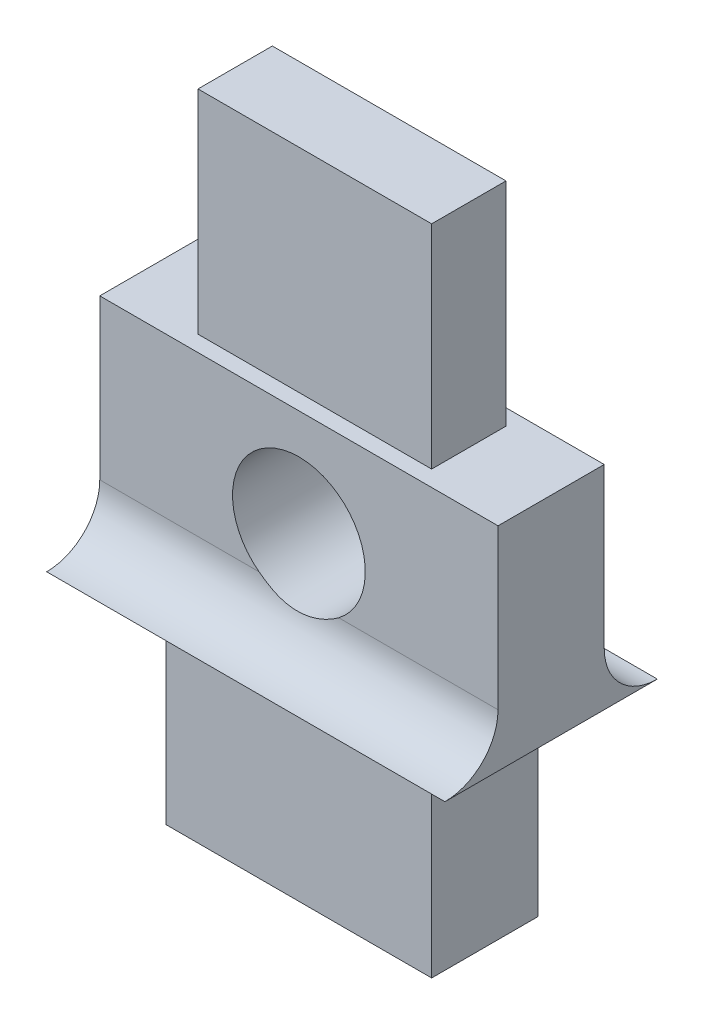
ISO-10303-21;
HEADER;
FILE_DESCRIPTION(('STEP AP214'),'2;1');
FILE_NAME('part.step','',(''),(''),'','','');
FILE_SCHEMA(('AUTOMOTIVE_DESIGN { 1 0 10303 214 1 1 1 1 }'));
ENDSEC;
DATA;
#1=APPLICATION_CONTEXT('core data for automotive mechanical design processes');
#2=APPLICATION_PROTOCOL_DEFINITION('international standard','automotive_design',2000,#1);
#3=PRODUCT_CONTEXT('',#1,'mechanical');
#4=PRODUCT('Part','Part','',(#3));
#5=PRODUCT_RELATED_PRODUCT_CATEGORY('part','',(#4));
#6=PRODUCT_DEFINITION_FORMATION('','',#4);
#7=PRODUCT_DEFINITION_CONTEXT('part definition',#1,'design');
#8=PRODUCT_DEFINITION('design','',#6,#7);
#9=PRODUCT_DEFINITION_SHAPE('','',#8);
#10=(LENGTH_UNIT() NAMED_UNIT(*) SI_UNIT(.MILLI.,.METRE.));
#11=(NAMED_UNIT(*) PLANE_ANGLE_UNIT() SI_UNIT($,.RADIAN.));
#12=(NAMED_UNIT(*) SI_UNIT($,.STERADIAN.) SOLID_ANGLE_UNIT());
#13=UNCERTAINTY_MEASURE_WITH_UNIT(LENGTH_MEASURE(1.E-05),#10,'distance_accuracy_value','');
#14=(GEOMETRIC_REPRESENTATION_CONTEXT(3) GLOBAL_UNCERTAINTY_ASSIGNED_CONTEXT((#13)) GLOBAL_UNIT_ASSIGNED_CONTEXT((#10,
#11,#12)) REPRESENTATION_CONTEXT('',''));
#15=CARTESIAN_POINT('',(0.,0.,0.));
#16=DIRECTION('',(0.,0.,1.));
#17=DIRECTION('',(1.,0.,0.));
#18=AXIS2_PLACEMENT_3D('',#15,#16,#17);
#19=CARTESIAN_POINT('',(0.,0.,0.));
#20=DIRECTION('',(0.,0.,-1.));
#21=DIRECTION('',(-1.,0.,0.));
#22=AXIS2_PLACEMENT_3D('',#19,#20,#21);
#23=PLANE('',#22);
#24=DIRECTION('',(0.,-1.,0.));
#25=VECTOR('',#24,1.);
#26=CARTESIAN_POINT('',(1950.92680872112,1462.88411595094,0.));
#27=LINE('',#26,#25);
#28=CARTESIAN_POINT('',(1950.92680872112,1462.88411595094,0.));
#29=VERTEX_POINT('',#28);
#30=CARTESIAN_POINT('',(1950.92680872112,1459.88411595094,0.));
#31=VERTEX_POINT('',#30);
#32=EDGE_CURVE('E294',#29,#31,#27,.T.);
#33=ORIENTED_EDGE('',*,*,#32,.F.);
#34=DIRECTION('',(-1.,0.,0.));
#35=VECTOR('',#34,1.);
#36=CARTESIAN_POINT('',(1957.17680872112,1462.88411595094,0.));
#37=LINE('',#36,#35);
#38=CARTESIAN_POINT('',(1958.42680872112,1462.88411595094,0.));
#39=VERTEX_POINT('',#38);
#40=EDGE_CURVE('E319',#39,#29,#37,.T.);
#41=ORIENTED_EDGE('',*,*,#40,.F.);
#42=DIRECTION('',(1.11022302462522E-13,1.,0.));
#43=VECTOR('',#42,1.);
#44=CARTESIAN_POINT('',(1958.42680872112,1462.88411595094,0.));
#45=LINE('',#44,#43);
#46=CARTESIAN_POINT('',(1958.42680872112,1459.88411595094,0.));
#47=VERTEX_POINT('',#46);
#48=EDGE_CURVE('E260',#47,#39,#45,.T.);
#49=ORIENTED_EDGE('',*,*,#48,.F.);
#50=DIRECTION('',(-1.,0.,0.));
#51=VECTOR('',#50,1.);
#52=CARTESIAN_POINT('',(1959.84102228349,1459.88411595094,0.));
#53=LINE('',#52,#51);
#54=CARTESIAN_POINT('',(1955.42680872111,1459.88411595094,0.));
#55=VERTEX_POINT('',#54);
#56=EDGE_CURVE('E297',#47,#55,#53,.T.);
#57=ORIENTED_EDGE('',*,*,#56,.T.);
#58=CARTESIAN_POINT('',(1954.67680872112,1460.88411595095,0.));
#59=DIRECTION('',(0.,0.,1.));
#60=DIRECTION('',(1.,0.,0.));
#61=AXIS2_PLACEMENT_3D('',#58,#59,#60);
#62=CIRCLE('',#61,1.24999999999997);
#63=CARTESIAN_POINT('',(1953.92680872112,1459.88411595094,0.));
#64=VERTEX_POINT('',#63);
#65=EDGE_CURVE('E311',#55,#64,#62,.T.);
#66=ORIENTED_EDGE('',*,*,#65,.T.);
#67=EDGE_CURVE('E55',#64,#31,#53,.T.);
#68=ORIENTED_EDGE('',*,*,#67,.T.);
#69=EDGE_LOOP('',(#33,#41,#49,#57,#66,#68));
#70=FACE_BOUND('',#69,.T.);
#71=ADVANCED_FACE('F32',(#70),#23,.T.);
#72=CARTESIAN_POINT('',(0.,0.,2.));
#73=DIRECTION('',(0.,0.,-1.));
#74=DIRECTION('',(-1.,0.,0.));
#75=AXIS2_PLACEMENT_3D('',#72,#73,#74);
#76=PLANE('',#75);
#77=DIRECTION('',(0.,1.,0.));
#78=VECTOR('',#77,1.);
#79=CARTESIAN_POINT('',(1957.17680872112,1458.88411595094,2.));
#80=LINE('',#79,#78);
#81=CARTESIAN_POINT('',(1957.17680872112,1454.88411595094,2.));
#82=VERTEX_POINT('',#81);
#83=CARTESIAN_POINT('',(1957.17680872112,1458.88411595094,2.));
#84=VERTEX_POINT('',#83);
#85=EDGE_CURVE('E326',#82,#84,#80,.T.);
#86=ORIENTED_EDGE('',*,*,#85,.T.);
#87=DIRECTION('',(-1.,0.,0.));
#88=VECTOR('',#87,1.);
#89=CARTESIAN_POINT('',(1959.84102228349,1458.88411595094,2.));
#90=LINE('',#89,#88);
#91=CARTESIAN_POINT('',(1952.17680872112,1458.88411595094,2.));
#92=VERTEX_POINT('',#91);
#93=EDGE_CURVE('E265',#84,#92,#90,.T.);
#94=ORIENTED_EDGE('',*,*,#93,.T.);
#95=DIRECTION('',(-2.22044604925031E-13,-1.,0.));
#96=VECTOR('',#95,1.);
#97=CARTESIAN_POINT('',(1952.17680872112,1458.88411595094,2.));
#98=LINE('',#97,#96);
#99=CARTESIAN_POINT('',(1952.17680872112,1454.88411595094,2.));
#100=VERTEX_POINT('',#99);
#101=EDGE_CURVE('E322',#92,#100,#98,.T.);
#102=ORIENTED_EDGE('',*,*,#101,.T.);
#103=DIRECTION('',(1.,0.,0.));
#104=VECTOR('',#103,1.);
#105=CARTESIAN_POINT('',(1952.17680872112,1454.88411595094,2.));
#106=LINE('',#105,#104);
#107=EDGE_CURVE('E324',#100,#82,#106,.T.);
#108=ORIENTED_EDGE('',*,*,#107,.T.);
#109=EDGE_LOOP('',(#86,#94,#102,#108));
#110=FACE_BOUND('',#109,.T.);
#111=ADVANCED_FACE('F219',(#110),#76,.F.);
#112=DIRECTION('',(1.11022302462522E-13,1.,0.));
#113=VECTOR('',#112,1.);
#114=CARTESIAN_POINT('',(1958.42680872112,1462.88411595094,2.));
#115=LINE('',#114,#113);
#116=CARTESIAN_POINT('',(1958.42680872112,1459.88411595094,2.));
#117=VERTEX_POINT('',#116);
#118=CARTESIAN_POINT('',(1958.42680872112,1462.88411595094,2.));
#119=VERTEX_POINT('',#118);
#120=EDGE_CURVE('E328',#117,#119,#115,.T.);
#121=ORIENTED_EDGE('',*,*,#120,.T.);
#122=DIRECTION('',(-1.,0.,0.));
#123=VECTOR('',#122,1.);
#124=CARTESIAN_POINT('',(1952.17680872112,1462.88411595094,2.));
#125=LINE('',#124,#123);
#126=CARTESIAN_POINT('',(1950.92680872112,1462.88411595094,2.));
#127=VERTEX_POINT('',#126);
#128=EDGE_CURVE('E316',#119,#127,#125,.T.);
#129=ORIENTED_EDGE('',*,*,#128,.T.);
#130=DIRECTION('',(0.,-1.,0.));
#131=VECTOR('',#130,1.);
#132=CARTESIAN_POINT('',(1950.92680872112,1462.88411595094,2.));
#133=LINE('',#132,#131);
#134=CARTESIAN_POINT('',(1950.92680872112,1459.88411595094,2.));
#135=VERTEX_POINT('',#134);
#136=EDGE_CURVE('E318',#127,#135,#133,.T.);
#137=ORIENTED_EDGE('',*,*,#136,.T.);
#138=DIRECTION('',(-1.,0.,0.));
#139=VECTOR('',#138,1.);
#140=CARTESIAN_POINT('',(1959.84102228349,1459.88411595094,2.));
#141=LINE('',#140,#139);
#142=CARTESIAN_POINT('',(1953.92680872112,1459.88411595094,2.));
#143=VERTEX_POINT('',#142);
#144=EDGE_CURVE('E307',#143,#135,#141,.T.);
#145=ORIENTED_EDGE('',*,*,#144,.F.);
#146=CARTESIAN_POINT('',(1954.67680872112,1460.88411595095,2.));
#147=DIRECTION('',(0.,0.,1.));
#148=DIRECTION('',(1.,0.,0.));
#149=AXIS2_PLACEMENT_3D('',#146,#147,#148);
#150=CIRCLE('',#149,1.24999999999997);
#151=CARTESIAN_POINT('',(1955.42680872111,1459.88411595094,2.00000000000006));
#152=VERTEX_POINT('',#151);
#153=EDGE_CURVE('E312',#152,#143,#150,.T.);
#154=ORIENTED_EDGE('',*,*,#153,.F.);
#155=EDGE_CURVE('E304',#117,#152,#141,.T.);
#156=ORIENTED_EDGE('',*,*,#155,.F.);
#157=EDGE_LOOP('',(#121,#129,#137,#145,#154,#156));
#158=FACE_BOUND('',#157,.T.);
#159=ADVANCED_FACE('F225',(#158),#76,.F.);
#160=DIRECTION('',(-1.,0.,0.));
#161=VECTOR('',#160,1.);
#162=CARTESIAN_POINT('',(1959.84102228349,1458.88411595094,0.));
#163=LINE('',#162,#161);
#164=CARTESIAN_POINT('',(1957.17680872112,1458.88411595094,0.));
#165=VERTEX_POINT('',#164);
#166=CARTESIAN_POINT('',(1952.17680872112,1458.88411595094,0.));
#167=VERTEX_POINT('',#166);
#168=EDGE_CURVE('E242',#165,#167,#163,.T.);
#169=ORIENTED_EDGE('',*,*,#168,.F.);
#170=DIRECTION('',(0.,1.,0.));
#171=VECTOR('',#170,1.);
#172=CARTESIAN_POINT('',(1957.17680872112,1458.88411595094,0.));
#173=LINE('',#172,#171);
#174=CARTESIAN_POINT('',(1957.17680872112,1454.88411595094,0.));
#175=VERTEX_POINT('',#174);
#176=EDGE_CURVE('E245',#175,#165,#173,.T.);
#177=ORIENTED_EDGE('',*,*,#176,.F.);
#178=DIRECTION('',(1.,0.,0.));
#179=VECTOR('',#178,1.);
#180=CARTESIAN_POINT('',(1952.17680872112,1454.88411595094,0.));
#181=LINE('',#180,#179);
#182=CARTESIAN_POINT('',(1952.17680872112,1454.88411595094,0.));
#183=VERTEX_POINT('',#182);
#184=EDGE_CURVE('E261',#183,#175,#181,.T.);
#185=ORIENTED_EDGE('',*,*,#184,.F.);
#186=DIRECTION('',(-2.22044604925031E-13,-1.,0.));
#187=VECTOR('',#186,1.);
#188=CARTESIAN_POINT('',(1952.17680872112,1458.88411595094,0.));
#189=LINE('',#188,#187);
#190=EDGE_CURVE('E246',#167,#183,#189,.T.);
#191=ORIENTED_EDGE('',*,*,#190,.F.);
#192=EDGE_LOOP('',(#169,#177,#185,#191));
#193=FACE_BOUND('',#192,.T.);
#194=ADVANCED_FACE('F221',(#193),#23,.T.);
#195=CARTESIAN_POINT('',(1950.92680872112,1462.88411595094,2.));
#196=DIRECTION('',(1.,0.,0.));
#197=DIRECTION('',(0.,0.,-1.));
#198=AXIS2_PLACEMENT_3D('',#195,#196,#197);
#199=PLANE('',#198);
#200=ORIENTED_EDGE('',*,*,#32,.T.);
#201=CARTESIAN_POINT('',(1950.92680872112,1459.88411595094,-1.));
#202=DIRECTION('',(1.,0.,0.));
#203=DIRECTION('',(0.,0.,-1.));
#204=AXIS2_PLACEMENT_3D('',#201,#202,#203);
#205=CIRCLE('',#204,0.999999999999945);
#206=CARTESIAN_POINT('',(1950.92680872112,1458.88411595094,-1.));
#207=VERTEX_POINT('',#206);
#208=EDGE_CURVE('E289',#31,#207,#205,.T.);
#209=ORIENTED_EDGE('',*,*,#208,.T.);
#210=DIRECTION('',(0.,0.,-1.));
#211=VECTOR('',#210,1.);
#212=CARTESIAN_POINT('',(1950.92680872112,1458.88411595094,2.));
#213=LINE('',#212,#211);
#214=CARTESIAN_POINT('',(1950.92680872112,1458.88411595094,3.));
#215=VERTEX_POINT('',#214);
#216=EDGE_CURVE('E40',#215,#207,#213,.T.);
#217=ORIENTED_EDGE('',*,*,#216,.F.);
#218=CARTESIAN_POINT('',(1950.92680872112,1459.88411595094,3.));
#219=DIRECTION('',(1.,0.,0.));
#220=DIRECTION('',(0.,0.,1.));
#221=AXIS2_PLACEMENT_3D('',#218,#219,#220);
#222=CIRCLE('',#221,0.999999999999945);
#223=EDGE_CURVE('E300',#215,#135,#222,.T.);
#224=ORIENTED_EDGE('',*,*,#223,.T.);
#225=ORIENTED_EDGE('',*,*,#136,.F.);
#226=DIRECTION('',(0.,0.,-1.));
#227=VECTOR('',#226,1.);
#228=CARTESIAN_POINT('',(1950.92680872112,1462.88411595094,2.));
#229=LINE('',#228,#227);
#230=EDGE_CURVE('E11',#127,#29,#229,.T.);
#231=ORIENTED_EDGE('',*,*,#230,.T.);
#232=EDGE_LOOP('',(#200,#209,#217,#224,#225,#231));
#233=FACE_BOUND('',#232,.T.);
#234=ADVANCED_FACE('F230',(#233),#199,.F.);
#235=CARTESIAN_POINT('',(1952.17680872112,1458.88411595094,2.));
#236=DIRECTION('',(1.,-2.22044604925031E-13,0.));
#237=DIRECTION('',(2.22044604925031E-13,1.,0.));
#238=AXIS2_PLACEMENT_3D('',#235,#236,#237);
#239=PLANE('',#238);
#240=ORIENTED_EDGE('',*,*,#190,.T.);
#241=DIRECTION('',(0.,0.,-1.));
#242=VECTOR('',#241,1.);
#243=CARTESIAN_POINT('',(1952.17680872112,1454.88411595094,2.));
#244=LINE('',#243,#242);
#245=EDGE_CURVE('E269',#100,#183,#244,.T.);
#246=ORIENTED_EDGE('',*,*,#245,.F.);
#247=ORIENTED_EDGE('',*,*,#101,.F.);
#248=DIRECTION('',(0.,0.,-1.));
#249=VECTOR('',#248,1.);
#250=CARTESIAN_POINT('',(1952.17680872112,1458.88411595094,2.));
#251=LINE('',#250,#249);
#252=EDGE_CURVE('E277',#92,#167,#251,.T.);
#253=ORIENTED_EDGE('',*,*,#252,.T.);
#254=EDGE_LOOP('',(#240,#246,#247,#253));
#255=FACE_BOUND('',#254,.T.);
#256=ADVANCED_FACE('F236',(#255),#239,.F.);
#257=CARTESIAN_POINT('',(1952.17680872112,1454.88411595094,2.));
#258=DIRECTION('',(0.,1.,0.));
#259=DIRECTION('',(0.,0.,1.));
#260=AXIS2_PLACEMENT_3D('',#257,#258,#259);
#261=PLANE('',#260);
#262=ORIENTED_EDGE('',*,*,#184,.T.);
#263=DIRECTION('',(0.,0.,-1.));
#264=VECTOR('',#263,1.);
#265=CARTESIAN_POINT('',(1957.17680872112,1454.88411595094,2.));
#266=LINE('',#265,#264);
#267=EDGE_CURVE('E259',#82,#175,#266,.T.);
#268=ORIENTED_EDGE('',*,*,#267,.F.);
#269=ORIENTED_EDGE('',*,*,#107,.F.);
#270=ORIENTED_EDGE('',*,*,#245,.T.);
#271=EDGE_LOOP('',(#262,#268,#269,#270));
#272=FACE_BOUND('',#271,.T.);
#273=ADVANCED_FACE('F369',(#272),#261,.F.);
#274=CARTESIAN_POINT('',(1957.17680872112,1458.88411595094,2.));
#275=DIRECTION('',(-1.,0.,0.));
#276=DIRECTION('',(0.,0.,1.));
#277=AXIS2_PLACEMENT_3D('',#274,#275,#276);
#278=PLANE('',#277);
#279=ORIENTED_EDGE('',*,*,#176,.T.);
#280=DIRECTION('',(0.,0.,-1.));
#281=VECTOR('',#280,1.);
#282=CARTESIAN_POINT('',(1957.17680872112,1458.88411595094,2.));
#283=LINE('',#282,#281);
#284=EDGE_CURVE('E257',#84,#165,#283,.T.);
#285=ORIENTED_EDGE('',*,*,#284,.F.);
#286=ORIENTED_EDGE('',*,*,#85,.F.);
#287=ORIENTED_EDGE('',*,*,#267,.T.);
#288=EDGE_LOOP('',(#279,#285,#286,#287));
#289=FACE_BOUND('',#288,.T.);
#290=ADVANCED_FACE('F255',(#289),#278,.F.);
#291=CARTESIAN_POINT('',(1957.17680872112,1458.88411595094,2.));
#292=DIRECTION('',(0.,1.,0.));
#293=DIRECTION('',(0.,0.,1.));
#294=AXIS2_PLACEMENT_3D('',#291,#292,#293);
#295=PLANE('',#294);
#296=ORIENTED_EDGE('',*,*,#168,.T.);
#297=ORIENTED_EDGE('',*,*,#252,.F.);
#298=ORIENTED_EDGE('',*,*,#93,.F.);
#299=ORIENTED_EDGE('',*,*,#284,.T.);
#300=EDGE_LOOP('',(#296,#297,#298,#299));
#301=FACE_BOUND('',#300,.T.);
#302=ORIENTED_EDGE('',*,*,#216,.T.);
#303=DIRECTION('',(-1.,0.,0.));
#304=VECTOR('',#303,1.);
#305=CARTESIAN_POINT('',(1959.84102228349,1458.88411595094,-1.));
#306=LINE('',#305,#304);
#307=CARTESIAN_POINT('',(1958.42680872112,1458.88411595094,-1.));
#308=VERTEX_POINT('',#307);
#309=EDGE_CURVE('E250',#308,#207,#306,.T.);
#310=ORIENTED_EDGE('',*,*,#309,.F.);
#311=DIRECTION('',(0.,0.,-1.));
#312=VECTOR('',#311,1.);
#313=CARTESIAN_POINT('',(1958.42680872112,1458.88411595094,2.));
#314=LINE('',#313,#312);
#315=CARTESIAN_POINT('',(1958.42680872112,1458.88411595094,3.));
#316=VERTEX_POINT('',#315);
#317=EDGE_CURVE('E267',#316,#308,#314,.T.);
#318=ORIENTED_EDGE('',*,*,#317,.F.);
#319=DIRECTION('',(-1.,0.,0.));
#320=VECTOR('',#319,1.);
#321=CARTESIAN_POINT('',(1959.84102228349,1458.88411595094,3.));
#322=LINE('',#321,#320);
#323=EDGE_CURVE('E282',#316,#215,#322,.T.);
#324=ORIENTED_EDGE('',*,*,#323,.T.);
#325=EDGE_LOOP('',(#302,#310,#318,#324));
#326=FACE_BOUND('',#325,.T.);
#327=ADVANCED_FACE('F263',(#301,#326),#295,.F.);
#328=CARTESIAN_POINT('',(1958.42680872112,1462.88411595094,2.));
#329=DIRECTION('',(-1.,1.11022302462522E-13,0.));
#330=DIRECTION('',(-1.11022302462522E-13,-1.,0.));
#331=AXIS2_PLACEMENT_3D('',#328,#329,#330);
#332=PLANE('',#331);
#333=ORIENTED_EDGE('',*,*,#317,.T.);
#334=CARTESIAN_POINT('',(1958.42680872112,1459.88411595094,-1.));
#335=DIRECTION('',(-1.,1.11022302462522E-13,0.));
#336=DIRECTION('',(-1.11022302462522E-13,-1.,0.));
#337=AXIS2_PLACEMENT_3D('',#334,#335,#336);
#338=CIRCLE('',#337,0.999999999999945);
#339=EDGE_CURVE('E292',#308,#47,#338,.T.);
#340=ORIENTED_EDGE('',*,*,#339,.T.);
#341=ORIENTED_EDGE('',*,*,#48,.T.);
#342=DIRECTION('',(0.,0.,-1.));
#343=VECTOR('',#342,1.);
#344=CARTESIAN_POINT('',(1958.42680872112,1462.88411595094,2.));
#345=LINE('',#344,#343);
#346=EDGE_CURVE('E271',#119,#39,#345,.T.);
#347=ORIENTED_EDGE('',*,*,#346,.F.);
#348=ORIENTED_EDGE('',*,*,#120,.F.);
#349=CARTESIAN_POINT('',(1958.42680872112,1459.88411595094,3.));
#350=DIRECTION('',(-1.,1.11022302462522E-13,0.));
#351=DIRECTION('',(-1.11022302462522E-13,-1.,0.));
#352=AXIS2_PLACEMENT_3D('',#349,#350,#351);
#353=CIRCLE('',#352,0.999999999999945);
#354=EDGE_CURVE('E303',#117,#316,#353,.T.);
#355=ORIENTED_EDGE('',*,*,#354,.T.);
#356=EDGE_LOOP('',(#333,#340,#341,#347,#348,#355));
#357=FACE_BOUND('',#356,.T.);
#358=ADVANCED_FACE('F342',(#357),#332,.F.);
#359=CARTESIAN_POINT('',(1957.17680872112,1462.88411595094,2.));
#360=DIRECTION('',(0.,-1.,0.));
#361=DIRECTION('',(0.,0.,-1.));
#362=AXIS2_PLACEMENT_3D('',#359,#360,#361);
#363=PLANE('',#362);
#364=ORIENTED_EDGE('',*,*,#40,.T.);
#365=ORIENTED_EDGE('',*,*,#230,.F.);
#366=ORIENTED_EDGE('',*,*,#128,.F.);
#367=ORIENTED_EDGE('',*,*,#346,.T.);
#368=EDGE_LOOP('',(#364,#365,#366,#367));
#369=FACE_BOUND('',#368,.T.);
#370=DIRECTION('',(0.,0.,1.));
#371=VECTOR('',#370,1.);
#372=CARTESIAN_POINT('',(1952.47680872112,1462.88411595094,1.7));
#373=LINE('',#372,#371);
#374=CARTESIAN_POINT('',(1952.47680872112,1462.88411595094,0.3));
#375=VERTEX_POINT('',#374);
#376=CARTESIAN_POINT('',(1952.47680872112,1462.88411595094,1.7));
#377=VERTEX_POINT('',#376);
#378=EDGE_CURVE('E165',#375,#377,#373,.T.);
#379=ORIENTED_EDGE('',*,*,#378,.F.);
#380=DIRECTION('',(-1.,0.,0.));
#381=VECTOR('',#380,1.);
#382=CARTESIAN_POINT('',(1952.47680872112,1462.88411595094,0.3));
#383=LINE('',#382,#381);
#384=CARTESIAN_POINT('',(1956.87680872112,1462.88411595094,0.3));
#385=VERTEX_POINT('',#384);
#386=EDGE_CURVE('E159',#385,#375,#383,.T.);
#387=ORIENTED_EDGE('',*,*,#386,.F.);
#388=DIRECTION('',(0.,0.,-1.));
#389=VECTOR('',#388,1.);
#390=CARTESIAN_POINT('',(1956.87680872112,1462.88411595094,1.7));
#391=LINE('',#390,#389);
#392=CARTESIAN_POINT('',(1956.87680872112,1462.88411595094,1.7));
#393=VERTEX_POINT('',#392);
#394=EDGE_CURVE('E168',#393,#385,#391,.T.);
#395=ORIENTED_EDGE('',*,*,#394,.F.);
#396=DIRECTION('',(1.,0.,0.));
#397=VECTOR('',#396,1.);
#398=CARTESIAN_POINT('',(1952.47680872112,1462.88411595094,1.7));
#399=LINE('',#398,#397);
#400=EDGE_CURVE('E151',#377,#393,#399,.T.);
#401=ORIENTED_EDGE('',*,*,#400,.F.);
#402=EDGE_LOOP('',(#379,#387,#395,#401));
#403=FACE_BOUND('',#402,.T.);
#404=ADVANCED_FACE('F163',(#369,#403),#363,.F.);
#405=CARTESIAN_POINT('',(1954.67680872112,1460.88411595095,2.));
#406=DIRECTION('',(0.,0.,-1.));
#407=DIRECTION('',(-1.,0.,0.));
#408=AXIS2_PLACEMENT_3D('',#405,#406,#407);
#409=CYLINDRICAL_SURFACE('',#408,1.24999999999997);
#410=ORIENTED_EDGE('',*,*,#153,.T.);
#411=CARTESIAN_POINT('',(1953.92680872112,1459.88411595094,2.00000000000006));
#412=CARTESIAN_POINT('',(1953.95464186426,1459.86324053161,2.00000413601019));
#413=CARTESIAN_POINT('',(1953.98332445631,1459.84354558404,2.00065286249592));
#414=CARTESIAN_POINT('',(1954.04219362052,1459.80663247636,2.00283435504111));
#415=CARTESIAN_POINT('',(1954.07237951385,1459.78941321175,2.00436672532793));
#416=CARTESIAN_POINT('',(1954.16493643226,1459.74161719196,2.00968314842704));
#417=CARTESIAN_POINT('',(1954.22930871718,1459.71490069901,2.01418657178201));
#418=CARTESIAN_POINT('',(1954.36159209563,1459.67251971499,2.02240246556453));
#419=CARTESIAN_POINT('',(1954.42950212547,1459.65685192226,2.02611517204895));
#420=CARTESIAN_POINT('',(1954.56700929288,1459.63701636227,2.03095427102973));
#421=CARTESIAN_POINT('',(1954.63660414283,1459.63283379689,2.03208399125503));
#422=CARTESIAN_POINT('',(1954.77504472976,1459.63607168941,2.03125053742804));
#423=CARTESIAN_POINT('',(1954.84389239719,1459.64341702368,2.02930738765252));
#424=CARTESIAN_POINT('',(1954.97939950408,1459.66933001508,2.02324979340273));
#425=CARTESIAN_POINT('',(1955.04605666205,1459.68790900477,2.01913315683881));
#426=CARTESIAN_POINT('',(1955.16719027573,1459.7327467703,2.01129786180112));
#427=CARTESIAN_POINT('',(1955.2221396564,1459.75773340367,2.00759490859268));
#428=CARTESIAN_POINT('',(1955.30142399057,1459.80094387527,2.00336036664711));
#429=CARTESIAN_POINT('',(1955.32731779593,1459.816294206,2.00216907514131));
#430=CARTESIAN_POINT('',(1955.3779580889,1459.84884011021,2.00048997066709));
#431=CARTESIAN_POINT('',(1955.40270404076,1459.86603653315,2.00000248305203));
#432=CARTESIAN_POINT('',(1955.42680872111,1459.88411595094,2.00000000000006));
#433=B_SPLINE_CURVE_WITH_KNOTS('',3,(#411,#412,#413,#414,#415,#416,#417,#418,#419,#420,#421,
#422,#423,#424,#425,#426,#427,#428,#429,#430,#431,#432),.UNSPECIFIED.,.F.,.F.,(4,2,2,2,2,2,2,2,
2,2,4),(0.,0.104289480114433,0.208532286557596,0.417010423227884,0.625426234310823,
0.833573386174511,1.04036973220732,1.24737504408885,1.42813829488587,1.51843817128817,
1.60877977802348),.UNSPECIFIED.);
#434=EDGE_CURVE('E194',#143,#152,#433,.T.);
#435=ORIENTED_EDGE('',*,*,#434,.T.);
#436=EDGE_LOOP('',(#410,#435));
#437=FACE_BOUND('',#436,.T.);
#438=ORIENTED_EDGE('',*,*,#65,.F.);
#439=CARTESIAN_POINT('',(1955.42680872111,1459.88411595094,0.));
#440=CARTESIAN_POINT('',(1955.39897557797,1459.86324053161,-4.13601018518848E-06));
#441=CARTESIAN_POINT('',(1955.37029298592,1459.84354558404,-0.00065286249591931));
#442=CARTESIAN_POINT('',(1955.31142382171,1459.80663247636,-0.00283435504112357));
#443=CARTESIAN_POINT('',(1955.28123792838,1459.78941321175,-0.00436672532794736));
#444=CARTESIAN_POINT('',(1955.18868100997,1459.74161719196,-0.00968314842705621));
#445=CARTESIAN_POINT('',(1955.12430872505,1459.71490069901,-0.0141865717820136));
#446=CARTESIAN_POINT('',(1954.9920253466,1459.67251971499,-0.0224024655645303));
#447=CARTESIAN_POINT('',(1954.92411531676,1459.65685192226,-0.0261151720489534));
#448=CARTESIAN_POINT('',(1954.78660814936,1459.63701636227,-0.0309542710297293));
#449=CARTESIAN_POINT('',(1954.71701329941,1459.63283379689,-0.0320839912550294));
#450=CARTESIAN_POINT('',(1954.57857271248,1459.63607168941,-0.0312505374280387));
#451=CARTESIAN_POINT('',(1954.50972504504,1459.64341702368,-0.0293073876525235));
#452=CARTESIAN_POINT('',(1954.37421793816,1459.66933001508,-0.0232497934027292));
#453=CARTESIAN_POINT('',(1954.30756078018,1459.68790900477,-0.0191331568388102));
#454=CARTESIAN_POINT('',(1954.18642716651,1459.7327467703,-0.0112978618011222));
#455=CARTESIAN_POINT('',(1954.13147778584,1459.75773340367,-0.00759490859268298));
#456=CARTESIAN_POINT('',(1954.05219345166,1459.80094387527,-0.00336036664711868));
#457=CARTESIAN_POINT('',(1954.0262996463,1459.816294206,-0.00216907514131567));
#458=CARTESIAN_POINT('',(1953.97565935334,1459.84884011021,-0.000489970667087416));
#459=CARTESIAN_POINT('',(1953.95091340147,1459.86603653315,-2.48305202246684E-06));
#460=CARTESIAN_POINT('',(1953.92680872112,1459.88411595094,0.));
#461=B_SPLINE_CURVE_WITH_KNOTS('',3,(#439,#440,#441,#442,#443,#444,#445,#446,#447,#448,#449,
#450,#451,#452,#453,#454,#455,#456,#457,#458,#459,#460),.UNSPECIFIED.,.F.,.F.,(4,2,2,2,2,2,2,2,
2,2,4),(0.,0.104289480114742,0.208532286557905,0.417010423227902,0.625426234311108,
0.833573386174561,1.04036973220737,1.2473750440889,1.42813829488592,1.51843817128772,
1.60877977802353),.UNSPECIFIED.);
#462=EDGE_CURVE('E184',#55,#64,#461,.T.);
#463=ORIENTED_EDGE('',*,*,#462,.T.);
#464=EDGE_LOOP('',(#438,#463));
#465=FACE_BOUND('',#464,.T.);
#466=ADVANCED_FACE('F345',(#437,#465),#409,.F.);
#467=CARTESIAN_POINT('',(1959.84102228349,1459.88411595094,3.));
#468=DIRECTION('',(-1.,0.,0.));
#469=DIRECTION('',(0.,0.,1.));
#470=AXIS2_PLACEMENT_3D('',#467,#468,#469);
#471=CYLINDRICAL_SURFACE('',#470,0.999999999999945);
#472=ORIENTED_EDGE('',*,*,#434,.F.);
#473=ORIENTED_EDGE('',*,*,#144,.T.);
#474=ORIENTED_EDGE('',*,*,#223,.F.);
#475=ORIENTED_EDGE('',*,*,#323,.F.);
#476=ORIENTED_EDGE('',*,*,#354,.F.);
#477=ORIENTED_EDGE('',*,*,#155,.T.);
#478=EDGE_LOOP('',(#472,#473,#474,#475,#476,#477));
#479=FACE_BOUND('',#478,.T.);
#480=ADVANCED_FACE('F347',(#479),#471,.F.);
#481=CARTESIAN_POINT('',(1959.84102228349,1459.88411595094,-1.));
#482=DIRECTION('',(-1.,0.,0.));
#483=DIRECTION('',(0.,0.,1.));
#484=AXIS2_PLACEMENT_3D('',#481,#482,#483);
#485=CYLINDRICAL_SURFACE('',#484,0.999999999999945);
#486=ORIENTED_EDGE('',*,*,#462,.F.);
#487=ORIENTED_EDGE('',*,*,#56,.F.);
#488=ORIENTED_EDGE('',*,*,#339,.F.);
#489=ORIENTED_EDGE('',*,*,#309,.T.);
#490=ORIENTED_EDGE('',*,*,#208,.F.);
#491=ORIENTED_EDGE('',*,*,#67,.F.);
#492=EDGE_LOOP('',(#486,#487,#488,#489,#490,#491));
#493=FACE_BOUND('',#492,.T.);
#494=ADVANCED_FACE('F200',(#493),#485,.F.);
#495=CARTESIAN_POINT('',(1952.47680872112,1462.88411595094,1.7));
#496=DIRECTION('',(-1.,0.,0.));
#497=DIRECTION('',(0.,0.,1.));
#498=AXIS2_PLACEMENT_3D('',#495,#496,#497);
#499=PLANE('',#498);
#500=DIRECTION('',(0.,0.,1.));
#501=VECTOR('',#500,1.);
#502=CARTESIAN_POINT('',(1952.47680872112,1466.88411595094,1.7));
#503=LINE('',#502,#501);
#504=CARTESIAN_POINT('',(1952.47680872112,1466.88411595094,0.3));
#505=VERTEX_POINT('',#504);
#506=CARTESIAN_POINT('',(1952.47680872112,1466.88411595094,1.7));
#507=VERTEX_POINT('',#506);
#508=EDGE_CURVE('E179',#505,#507,#503,.T.);
#509=ORIENTED_EDGE('',*,*,#508,.F.);
#510=DIRECTION('',(0.,1.,0.));
#511=VECTOR('',#510,1.);
#512=CARTESIAN_POINT('',(1952.47680872112,1462.88411595094,0.3));
#513=LINE('',#512,#511);
#514=EDGE_CURVE('E171',#375,#505,#513,.T.);
#515=ORIENTED_EDGE('',*,*,#514,.F.);
#516=ORIENTED_EDGE('',*,*,#378,.T.);
#517=DIRECTION('',(0.,1.,0.));
#518=VECTOR('',#517,1.);
#519=CARTESIAN_POINT('',(1952.47680872112,1462.88411595094,1.7));
#520=LINE('',#519,#518);
#521=EDGE_CURVE('E148',#377,#507,#520,.T.);
#522=ORIENTED_EDGE('',*,*,#521,.T.);
#523=EDGE_LOOP('',(#509,#515,#516,#522));
#524=FACE_BOUND('',#523,.T.);
#525=ADVANCED_FACE('F170',(#524),#499,.T.);
#526=CARTESIAN_POINT('',(1952.47680872112,1462.88411595094,0.3));
#527=DIRECTION('',(0.,0.,-1.));
#528=DIRECTION('',(-1.,0.,0.));
#529=AXIS2_PLACEMENT_3D('',#526,#527,#528);
#530=PLANE('',#529);
#531=DIRECTION('',(-1.,0.,0.));
#532=VECTOR('',#531,1.);
#533=CARTESIAN_POINT('',(1952.47680872112,1466.88411595094,0.3));
#534=LINE('',#533,#532);
#535=CARTESIAN_POINT('',(1956.87680872112,1466.88411595094,0.3));
#536=VERTEX_POINT('',#535);
#537=EDGE_CURVE('E172',#536,#505,#534,.T.);
#538=ORIENTED_EDGE('',*,*,#537,.F.);
#539=DIRECTION('',(0.,1.,0.));
#540=VECTOR('',#539,1.);
#541=CARTESIAN_POINT('',(1956.87680872112,1462.88411595094,0.3));
#542=LINE('',#541,#540);
#543=EDGE_CURVE('E185',#385,#536,#542,.T.);
#544=ORIENTED_EDGE('',*,*,#543,.F.);
#545=ORIENTED_EDGE('',*,*,#386,.T.);
#546=ORIENTED_EDGE('',*,*,#514,.T.);
#547=EDGE_LOOP('',(#538,#544,#545,#546));
#548=FACE_BOUND('',#547,.T.);
#549=ADVANCED_FACE('F207',(#548),#530,.T.);
#550=CARTESIAN_POINT('',(1956.87680872112,1462.88411595094,1.7));
#551=DIRECTION('',(1.,0.,0.));
#552=DIRECTION('',(0.,0.,-1.));
#553=AXIS2_PLACEMENT_3D('',#550,#551,#552);
#554=PLANE('',#553);
#555=DIRECTION('',(0.,0.,-1.));
#556=VECTOR('',#555,1.);
#557=CARTESIAN_POINT('',(1956.87680872112,1466.88411595094,1.7));
#558=LINE('',#557,#556);
#559=CARTESIAN_POINT('',(1956.87680872112,1466.88411595094,1.7));
#560=VERTEX_POINT('',#559);
#561=EDGE_CURVE('E47',#560,#536,#558,.T.);
#562=ORIENTED_EDGE('',*,*,#561,.F.);
#563=DIRECTION('',(0.,1.,0.));
#564=VECTOR('',#563,1.);
#565=CARTESIAN_POINT('',(1956.87680872112,1462.88411595094,1.7));
#566=LINE('',#565,#564);
#567=EDGE_CURVE('E158',#393,#560,#566,.T.);
#568=ORIENTED_EDGE('',*,*,#567,.F.);
#569=ORIENTED_EDGE('',*,*,#394,.T.);
#570=ORIENTED_EDGE('',*,*,#543,.T.);
#571=EDGE_LOOP('',(#562,#568,#569,#570));
#572=FACE_BOUND('',#571,.T.);
#573=ADVANCED_FACE('F210',(#572),#554,.T.);
#574=CARTESIAN_POINT('',(1952.47680872112,1462.88411595094,1.7));
#575=DIRECTION('',(0.,0.,1.));
#576=DIRECTION('',(1.,0.,0.));
#577=AXIS2_PLACEMENT_3D('',#574,#575,#576);
#578=PLANE('',#577);
#579=DIRECTION('',(1.,0.,0.));
#580=VECTOR('',#579,1.);
#581=CARTESIAN_POINT('',(1952.47680872112,1466.88411595094,1.7));
#582=LINE('',#581,#580);
#583=EDGE_CURVE('E153',#507,#560,#582,.T.);
#584=ORIENTED_EDGE('',*,*,#583,.F.);
#585=ORIENTED_EDGE('',*,*,#521,.F.);
#586=ORIENTED_EDGE('',*,*,#400,.T.);
#587=ORIENTED_EDGE('',*,*,#567,.T.);
#588=EDGE_LOOP('',(#584,#585,#586,#587));
#589=FACE_BOUND('',#588,.T.);
#590=ADVANCED_FACE('F150',(#589),#578,.T.);
#591=CARTESIAN_POINT('',(1952.17680872112,1466.88411595094,2.));
#592=DIRECTION('',(0.,-1.,0.));
#593=DIRECTION('',(0.,0.,-1.));
#594=AXIS2_PLACEMENT_3D('',#591,#592,#593);
#595=PLANE('',#594);
#596=ORIENTED_EDGE('',*,*,#508,.T.);
#597=ORIENTED_EDGE('',*,*,#583,.T.);
#598=ORIENTED_EDGE('',*,*,#561,.T.);
#599=ORIENTED_EDGE('',*,*,#537,.T.);
#600=EDGE_LOOP('',(#596,#597,#598,#599));
#601=FACE_BOUND('',#600,.T.);
#602=ADVANCED_FACE('F34',(#601),#595,.F.);
#603=CLOSED_SHELL('',(#71,#111,#159,#194,#234,#256,#273,#290,#327,#358,#404,#466,#480,#494,#525,
#549,#573,#590,#602));
#604=MANIFOLD_SOLID_BREP('B2',#603);
#605=ADVANCED_BREP_SHAPE_REPRESENTATION('',(#18,#604),#14);
#606=SHAPE_DEFINITION_REPRESENTATION(#9,#605);
ENDSEC;
END-ISO-10303-21;
